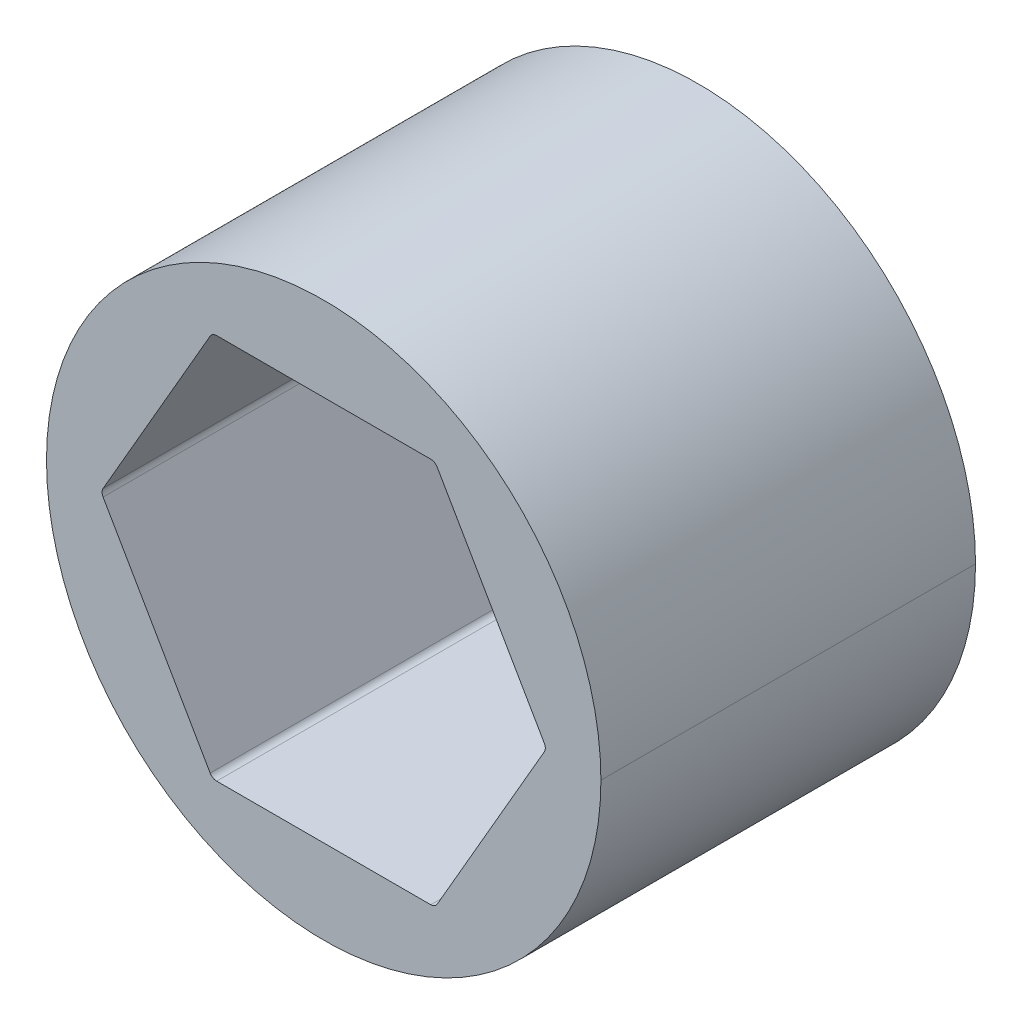
ISO-10303-21;
HEADER;
FILE_DESCRIPTION(('STEP AP214'),'2;1');
FILE_NAME('part.step','',(''),(''),'','','');
FILE_SCHEMA(('AUTOMOTIVE_DESIGN { 1 0 10303 214 1 1 1 1 }'));
ENDSEC;
DATA;
#1=APPLICATION_CONTEXT('core data for automotive mechanical design processes');
#2=APPLICATION_PROTOCOL_DEFINITION('international standard','automotive_design',2000,#1);
#3=PRODUCT_CONTEXT('',#1,'mechanical');
#4=PRODUCT('Part','Part','',(#3));
#5=PRODUCT_RELATED_PRODUCT_CATEGORY('part','',(#4));
#6=PRODUCT_DEFINITION_FORMATION('','',#4);
#7=PRODUCT_DEFINITION_CONTEXT('part definition',#1,'design');
#8=PRODUCT_DEFINITION('design','',#6,#7);
#9=PRODUCT_DEFINITION_SHAPE('','',#8);
#10=(LENGTH_UNIT() NAMED_UNIT(*) SI_UNIT(.MILLI.,.METRE.));
#11=(NAMED_UNIT(*) PLANE_ANGLE_UNIT() SI_UNIT($,.RADIAN.));
#12=(NAMED_UNIT(*) SI_UNIT($,.STERADIAN.) SOLID_ANGLE_UNIT());
#13=UNCERTAINTY_MEASURE_WITH_UNIT(LENGTH_MEASURE(1.E-05),#10,'distance_accuracy_value','');
#14=(GEOMETRIC_REPRESENTATION_CONTEXT(3) GLOBAL_UNCERTAINTY_ASSIGNED_CONTEXT((#13)) GLOBAL_UNIT_ASSIGNED_CONTEXT((#10,
#11,#12)) REPRESENTATION_CONTEXT('',''));
#15=CARTESIAN_POINT('',(0.,0.,0.));
#16=DIRECTION('',(0.,0.,1.));
#17=DIRECTION('',(1.,0.,0.));
#18=AXIS2_PLACEMENT_3D('',#15,#16,#17);
#19=CARTESIAN_POINT('',(7.25902493452117,0.,30.48));
#20=DIRECTION('',(0.,0.,1.));
#21=DIRECTION('',(1.,0.,0.));
#22=AXIS2_PLACEMENT_3D('',#19,#20,#21);
#23=CYLINDRICAL_SURFACE('',#22,0.254);
#24=CARTESIAN_POINT('',(7.25902493452117,0.,12.7));
#25=DIRECTION('',(0.,0.,1.));
#26=DIRECTION('',(1.,0.,0.));
#27=AXIS2_PLACEMENT_3D('',#24,#25,#26);
#28=CIRCLE('',#27,0.254);
#29=CARTESIAN_POINT('',(7.47899538708242,0.127,12.7));
#30=VERTEX_POINT('',#29);
#31=CARTESIAN_POINT('',(7.51302493452117,0.,12.7));
#32=VERTEX_POINT('',#31);
#33=EDGE_CURVE('E303',#30,#32,#28,.F.);
#34=ORIENTED_EDGE('',*,*,#33,.F.);
#35=DIRECTION('',(0.,0.,1.));
#36=VECTOR('',#35,1.);
#37=CARTESIAN_POINT('',(7.47899538708242,0.127,30.48));
#38=LINE('',#37,#36);
#39=CARTESIAN_POINT('',(7.47899538708242,0.127,0.));
#40=VERTEX_POINT('',#39);
#41=EDGE_CURVE('E269',#40,#30,#38,.T.);
#42=ORIENTED_EDGE('',*,*,#41,.F.);
#43=CARTESIAN_POINT('',(7.25902493452117,0.,0.));
#44=DIRECTION('',(0.,0.,1.));
#45=DIRECTION('',(1.,0.,0.));
#46=AXIS2_PLACEMENT_3D('',#43,#44,#45);
#47=CIRCLE('',#46,0.254);
#48=CARTESIAN_POINT('',(7.51302493452117,0.,0.));
#49=VERTEX_POINT('',#48);
#50=EDGE_CURVE('E201',#49,#40,#47,.T.);
#51=ORIENTED_EDGE('',*,*,#50,.F.);
#52=DIRECTION('',(0.,0.,1.));
#53=VECTOR('',#52,1.);
#54=CARTESIAN_POINT('',(7.51302493452117,0.,30.48));
#55=LINE('',#54,#53);
#56=EDGE_CURVE('E54',#49,#32,#55,.T.);
#57=ORIENTED_EDGE('',*,*,#56,.T.);
#58=EDGE_LOOP('',(#34,#42,#51,#57));
#59=FACE_BOUND('',#58,.T.);
#60=ADVANCED_FACE('F45',(#59),#23,.F.);
#61=CARTESIAN_POINT('',(0.,0.,30.48));
#62=DIRECTION('',(0.,0.,-1.));
#63=DIRECTION('',(-1.,0.,0.));
#64=AXIS2_PLACEMENT_3D('',#61,#62,#63);
#65=CYLINDRICAL_SURFACE('',#64,9.398);
#66=DIRECTION('',(0.,0.,-1.));
#67=VECTOR('',#66,1.);
#68=CARTESIAN_POINT('',(-9.398,0.,30.48));
#69=LINE('',#68,#67);
#70=CARTESIAN_POINT('',(-9.398,0.,12.7));
#71=VERTEX_POINT('',#70);
#72=CARTESIAN_POINT('',(-9.398,0.,0.));
#73=VERTEX_POINT('',#72);
#74=EDGE_CURVE('E176',#71,#73,#69,.T.);
#75=ORIENTED_EDGE('',*,*,#74,.F.);
#76=CARTESIAN_POINT('',(0.,0.,12.7));
#77=DIRECTION('',(0.,0.,1.));
#78=DIRECTION('',(1.,0.,0.));
#79=AXIS2_PLACEMENT_3D('',#76,#77,#78);
#80=CIRCLE('',#79,9.398);
#81=CARTESIAN_POINT('',(9.398,0.,12.7));
#82=VERTEX_POINT('',#81);
#83=EDGE_CURVE('E60',#82,#71,#80,.T.);
#84=ORIENTED_EDGE('',*,*,#83,.F.);
#85=DIRECTION('',(0.,0.,-1.));
#86=VECTOR('',#85,1.);
#87=CARTESIAN_POINT('',(9.398,0.,30.48));
#88=LINE('',#87,#86);
#89=CARTESIAN_POINT('',(9.398,0.,0.));
#90=VERTEX_POINT('',#89);
#91=EDGE_CURVE('E174',#82,#90,#88,.T.);
#92=ORIENTED_EDGE('',*,*,#91,.T.);
#93=CARTESIAN_POINT('',(0.,0.,0.));
#94=DIRECTION('',(0.,0.,1.));
#95=DIRECTION('',(1.,0.,0.));
#96=AXIS2_PLACEMENT_3D('',#93,#94,#95);
#97=CIRCLE('',#96,9.398);
#98=EDGE_CURVE('E183',#90,#73,#97,.T.);
#99=ORIENTED_EDGE('',*,*,#98,.T.);
#100=EDGE_LOOP('',(#75,#84,#92,#99));
#101=FACE_BOUND('',#100,.T.);
#102=ADVANCED_FACE('F172',(#101),#65,.T.);
#103=CARTESIAN_POINT('',(0.,0.,30.48));
#104=DIRECTION('',(0.,0.,-1.));
#105=DIRECTION('',(-1.,0.,0.));
#106=AXIS2_PLACEMENT_3D('',#103,#104,#105);
#107=CYLINDRICAL_SURFACE('',#106,9.398);
#108=ORIENTED_EDGE('',*,*,#91,.F.);
#109=EDGE_CURVE('E164',#71,#82,#80,.T.);
#110=ORIENTED_EDGE('',*,*,#109,.F.);
#111=ORIENTED_EDGE('',*,*,#74,.T.);
#112=CARTESIAN_POINT('',(0.,0.,0.));
#113=DIRECTION('',(0.,0.,1.));
#114=DIRECTION('',(1.,0.,0.));
#115=AXIS2_PLACEMENT_3D('',#112,#113,#114);
#116=CIRCLE('',#115,9.398);
#117=EDGE_CURVE('E181',#73,#90,#116,.T.);
#118=ORIENTED_EDGE('',*,*,#117,.T.);
#119=EDGE_LOOP('',(#108,#110,#111,#118));
#120=FACE_BOUND('',#119,.T.);
#121=ADVANCED_FACE('F179',(#120),#107,.T.);
#122=CARTESIAN_POINT('',(3.77615943563475,-6.5405,30.48));
#123=DIRECTION('',(-0.866025403784439,0.5,0.));
#124=DIRECTION('',(0.,0.,1.));
#125=AXIS2_PLACEMENT_3D('',#122,#123,#124);
#126=PLANE('',#125);
#127=DIRECTION('',(0.,0.,1.));
#128=VECTOR('',#127,1.);
#129=CARTESIAN_POINT('',(3.84948291982184,-6.4135,30.48));
#130=LINE('',#129,#128);
#131=CARTESIAN_POINT('',(3.84948291982184,-6.4135,0.));
#132=VERTEX_POINT('',#131);
#133=CARTESIAN_POINT('',(3.84948291982184,-6.4135,12.7));
#134=VERTEX_POINT('',#133);
#135=EDGE_CURVE('E220',#132,#134,#130,.T.);
#136=ORIENTED_EDGE('',*,*,#135,.T.);
#137=DIRECTION('',(0.5,0.866025403784439,0.));
#138=VECTOR('',#137,1.);
#139=CARTESIAN_POINT('',(3.77615943563475,-6.5405,12.7));
#140=LINE('',#139,#138);
#141=CARTESIAN_POINT('',(7.47899538708242,-0.127000000000001,12.7));
#142=VERTEX_POINT('',#141);
#143=EDGE_CURVE('E313',#134,#142,#140,.T.);
#144=ORIENTED_EDGE('',*,*,#143,.T.);
#145=DIRECTION('',(0.,0.,-1.));
#146=VECTOR('',#145,1.);
#147=CARTESIAN_POINT('',(7.47899538708242,-0.127,0.));
#148=LINE('',#147,#146);
#149=CARTESIAN_POINT('',(7.47899538708242,-0.127000000000001,0.));
#150=VERTEX_POINT('',#149);
#151=EDGE_CURVE('E224',#142,#150,#148,.T.);
#152=ORIENTED_EDGE('',*,*,#151,.T.);
#153=DIRECTION('',(0.5,0.866025403784439,0.));
#154=VECTOR('',#153,1.);
#155=CARTESIAN_POINT('',(3.77615943563475,-6.5405,0.));
#156=LINE('',#155,#154);
#157=EDGE_CURVE('E200',#132,#150,#156,.T.);
#158=ORIENTED_EDGE('',*,*,#157,.F.);
#159=EDGE_LOOP('',(#136,#144,#152,#158));
#160=FACE_BOUND('',#159,.T.);
#161=ADVANCED_FACE('F465',(#160),#126,.T.);
#162=CARTESIAN_POINT('',(7.5523188712695,0.,30.48));
#163=DIRECTION('',(-0.866025403784438,-0.5,0.));
#164=DIRECTION('',(-0.5,0.866025403784438,0.));
#165=AXIS2_PLACEMENT_3D('',#162,#163,#164);
#166=PLANE('',#165);
#167=ORIENTED_EDGE('',*,*,#41,.T.);
#168=DIRECTION('',(-0.5,0.866025403784438,0.));
#169=VECTOR('',#168,1.);
#170=CARTESIAN_POINT('',(7.5523188712695,0.,12.7));
#171=LINE('',#170,#169);
#172=CARTESIAN_POINT('',(3.84948291982183,6.4135,12.7));
#173=VERTEX_POINT('',#172);
#174=EDGE_CURVE('E298',#30,#173,#171,.T.);
#175=ORIENTED_EDGE('',*,*,#174,.T.);
#176=DIRECTION('',(0.,0.,-1.));
#177=VECTOR('',#176,1.);
#178=CARTESIAN_POINT('',(3.84948291982183,6.4135,0.));
#179=LINE('',#178,#177);
#180=CARTESIAN_POINT('',(3.84948291982183,6.4135,0.));
#181=VERTEX_POINT('',#180);
#182=EDGE_CURVE('E230',#173,#181,#179,.T.);
#183=ORIENTED_EDGE('',*,*,#182,.T.);
#184=DIRECTION('',(-0.5,0.866025403784438,0.));
#185=VECTOR('',#184,1.);
#186=CARTESIAN_POINT('',(7.5523188712695,0.,0.));
#187=LINE('',#186,#185);
#188=EDGE_CURVE('E228',#40,#181,#187,.T.);
#189=ORIENTED_EDGE('',*,*,#188,.F.);
#190=EDGE_LOOP('',(#167,#175,#183,#189));
#191=FACE_BOUND('',#190,.T.);
#192=ADVANCED_FACE('F297',(#191),#166,.T.);
#193=CARTESIAN_POINT('',(3.77615943563475,6.5405,30.48));
#194=DIRECTION('',(0.,-1.,0.));
#195=DIRECTION('',(0.,0.,-1.));
#196=AXIS2_PLACEMENT_3D('',#193,#194,#195);
#197=PLANE('',#196);
#198=DIRECTION('',(0.,0.,1.));
#199=VECTOR('',#198,1.);
#200=CARTESIAN_POINT('',(3.62951246726058,6.5405,30.48));
#201=LINE('',#200,#199);
#202=CARTESIAN_POINT('',(3.62951246726058,6.5405,0.));
#203=VERTEX_POINT('',#202);
#204=CARTESIAN_POINT('',(3.62951246726058,6.5405,12.7));
#205=VERTEX_POINT('',#204);
#206=EDGE_CURVE('E265',#203,#205,#201,.T.);
#207=ORIENTED_EDGE('',*,*,#206,.T.);
#208=DIRECTION('',(-1.,0.,0.));
#209=VECTOR('',#208,1.);
#210=CARTESIAN_POINT('',(3.77615943563475,6.5405,12.7));
#211=LINE('',#210,#209);
#212=CARTESIAN_POINT('',(-3.62951246726058,6.5405,12.7));
#213=VERTEX_POINT('',#212);
#214=EDGE_CURVE('E325',#205,#213,#211,.T.);
#215=ORIENTED_EDGE('',*,*,#214,.T.);
#216=DIRECTION('',(0.,0.,-1.));
#217=VECTOR('',#216,1.);
#218=CARTESIAN_POINT('',(-3.62951246726058,6.5405,0.));
#219=LINE('',#218,#217);
#220=CARTESIAN_POINT('',(-3.62951246726058,6.5405,0.));
#221=VERTEX_POINT('',#220);
#222=EDGE_CURVE('E270',#213,#221,#219,.T.);
#223=ORIENTED_EDGE('',*,*,#222,.T.);
#224=DIRECTION('',(-1.,0.,0.));
#225=VECTOR('',#224,1.);
#226=CARTESIAN_POINT('',(3.77615943563475,6.5405,0.));
#227=LINE('',#226,#225);
#228=EDGE_CURVE('E253',#203,#221,#227,.T.);
#229=ORIENTED_EDGE('',*,*,#228,.F.);
#230=EDGE_LOOP('',(#207,#215,#223,#229));
#231=FACE_BOUND('',#230,.T.);
#232=ADVANCED_FACE('F484',(#231),#197,.T.);
#233=CARTESIAN_POINT('',(-3.77615943563474,6.5405,30.48));
#234=DIRECTION('',(0.866025403784439,-0.5,0.));
#235=DIRECTION('',(0.,0.,-1.));
#236=AXIS2_PLACEMENT_3D('',#233,#234,#235);
#237=PLANE('',#236);
#238=DIRECTION('',(0.,0.,1.));
#239=VECTOR('',#238,1.);
#240=CARTESIAN_POINT('',(-3.84948291982183,6.4135,30.48));
#241=LINE('',#240,#239);
#242=CARTESIAN_POINT('',(-3.84948291982183,6.4135,0.));
#243=VERTEX_POINT('',#242);
#244=CARTESIAN_POINT('',(-3.84948291982183,6.4135,12.7));
#245=VERTEX_POINT('',#244);
#246=EDGE_CURVE('E194',#243,#245,#241,.T.);
#247=ORIENTED_EDGE('',*,*,#246,.T.);
#248=DIRECTION('',(-0.5,-0.866025403784439,0.));
#249=VECTOR('',#248,1.);
#250=CARTESIAN_POINT('',(-3.77615943563474,6.5405,12.7));
#251=LINE('',#250,#249);
#252=CARTESIAN_POINT('',(-7.47899538708242,0.127000000000006,12.7));
#253=VERTEX_POINT('',#252);
#254=EDGE_CURVE('E339',#245,#253,#251,.T.);
#255=ORIENTED_EDGE('',*,*,#254,.T.);
#256=DIRECTION('',(0.,0.,-1.));
#257=VECTOR('',#256,1.);
#258=CARTESIAN_POINT('',(-7.47899538708241,0.127000000000002,0.));
#259=LINE('',#258,#257);
#260=CARTESIAN_POINT('',(-7.47899538708241,0.127000000000003,0.));
#261=VERTEX_POINT('',#260);
#262=EDGE_CURVE('E243',#253,#261,#259,.T.);
#263=ORIENTED_EDGE('',*,*,#262,.T.);
#264=DIRECTION('',(-0.5,-0.866025403784439,0.));
#265=VECTOR('',#264,1.);
#266=CARTESIAN_POINT('',(-3.77615943563474,6.5405,0.));
#267=LINE('',#266,#265);
#268=EDGE_CURVE('E254',#243,#261,#267,.T.);
#269=ORIENTED_EDGE('',*,*,#268,.F.);
#270=EDGE_LOOP('',(#247,#255,#263,#269));
#271=FACE_BOUND('',#270,.T.);
#272=ADVANCED_FACE('F360',(#271),#237,.T.);
#273=CARTESIAN_POINT('',(-7.5523188712695,0.,30.48));
#274=DIRECTION('',(0.866025403784439,0.5,0.));
#275=DIRECTION('',(0.,0.,-1.));
#276=AXIS2_PLACEMENT_3D('',#273,#274,#275);
#277=PLANE('',#276);
#278=DIRECTION('',(0.,0.,1.));
#279=VECTOR('',#278,1.);
#280=CARTESIAN_POINT('',(-7.47899538708241,-0.126999999999998,30.48));
#281=LINE('',#280,#279);
#282=CARTESIAN_POINT('',(-7.47899538708241,-0.126999999999999,0.));
#283=VERTEX_POINT('',#282);
#284=CARTESIAN_POINT('',(-7.47899538708241,-0.126999999999998,12.7));
#285=VERTEX_POINT('',#284);
#286=EDGE_CURVE('E207',#283,#285,#281,.T.);
#287=ORIENTED_EDGE('',*,*,#286,.T.);
#288=DIRECTION('',(0.5,-0.866025403784439,0.));
#289=VECTOR('',#288,1.);
#290=CARTESIAN_POINT('',(-7.5523188712695,0.,12.7));
#291=LINE('',#290,#289);
#292=CARTESIAN_POINT('',(-3.84948291982184,-6.4135,12.7));
#293=VERTEX_POINT('',#292);
#294=EDGE_CURVE('E67',#285,#293,#291,.T.);
#295=ORIENTED_EDGE('',*,*,#294,.T.);
#296=DIRECTION('',(0.,0.,-1.));
#297=VECTOR('',#296,1.);
#298=CARTESIAN_POINT('',(-3.84948291982183,-6.4135,0.));
#299=LINE('',#298,#297);
#300=CARTESIAN_POINT('',(-3.84948291982183,-6.4135,0.));
#301=VERTEX_POINT('',#300);
#302=EDGE_CURVE('E211',#293,#301,#299,.T.);
#303=ORIENTED_EDGE('',*,*,#302,.T.);
#304=DIRECTION('',(0.5,-0.866025403784439,0.));
#305=VECTOR('',#304,1.);
#306=CARTESIAN_POINT('',(-7.5523188712695,0.,0.));
#307=LINE('',#306,#305);
#308=EDGE_CURVE('E219',#283,#301,#307,.T.);
#309=ORIENTED_EDGE('',*,*,#308,.F.);
#310=EDGE_LOOP('',(#287,#295,#303,#309));
#311=FACE_BOUND('',#310,.T.);
#312=ADVANCED_FACE('F346',(#311),#277,.T.);
#313=CARTESIAN_POINT('',(-3.77615943563474,-6.5405,30.48));
#314=DIRECTION('',(0.,1.,0.));
#315=DIRECTION('',(1.,0.,0.));
#316=AXIS2_PLACEMENT_3D('',#313,#314,#315);
#317=PLANE('',#316);
#318=DIRECTION('',(0.,0.,1.));
#319=VECTOR('',#318,1.);
#320=CARTESIAN_POINT('',(-3.62951246726058,-6.5405,30.48));
#321=LINE('',#320,#319);
#322=CARTESIAN_POINT('',(-3.62951246726058,-6.5405,0.));
#323=VERTEX_POINT('',#322);
#324=CARTESIAN_POINT('',(-3.62951246726058,-6.5405,12.7));
#325=VERTEX_POINT('',#324);
#326=EDGE_CURVE('E205',#323,#325,#321,.T.);
#327=ORIENTED_EDGE('',*,*,#326,.T.);
#328=DIRECTION('',(1.,0.,0.));
#329=VECTOR('',#328,1.);
#330=CARTESIAN_POINT('',(-3.77615943563474,-6.5405,12.7));
#331=LINE('',#330,#329);
#332=CARTESIAN_POINT('',(3.62951246726059,-6.5405,12.7));
#333=VERTEX_POINT('',#332);
#334=EDGE_CURVE('E329',#325,#333,#331,.T.);
#335=ORIENTED_EDGE('',*,*,#334,.T.);
#336=DIRECTION('',(0.,0.,-1.));
#337=VECTOR('',#336,1.);
#338=CARTESIAN_POINT('',(3.62951246726059,-6.5405,0.));
#339=LINE('',#338,#337);
#340=CARTESIAN_POINT('',(3.62951246726058,-6.5405,0.));
#341=VERTEX_POINT('',#340);
#342=EDGE_CURVE('E202',#333,#341,#339,.T.);
#343=ORIENTED_EDGE('',*,*,#342,.T.);
#344=DIRECTION('',(1.,0.,0.));
#345=VECTOR('',#344,1.);
#346=CARTESIAN_POINT('',(-3.77615943563474,-6.5405,0.));
#347=LINE('',#346,#345);
#348=EDGE_CURVE('E190',#323,#341,#347,.T.);
#349=ORIENTED_EDGE('',*,*,#348,.F.);
#350=EDGE_LOOP('',(#327,#335,#343,#349));
#351=FACE_BOUND('',#350,.T.);
#352=ADVANCED_FACE('F510',(#351),#317,.T.);
#353=CARTESIAN_POINT('',(3.62951246726058,6.2865,30.48));
#354=DIRECTION('',(0.,0.,1.));
#355=DIRECTION('',(1.,0.,0.));
#356=AXIS2_PLACEMENT_3D('',#353,#354,#355);
#357=CYLINDRICAL_SURFACE('',#356,0.254);
#358=CARTESIAN_POINT('',(3.62951246726058,6.2865,12.7));
#359=DIRECTION('',(0.,0.,1.));
#360=DIRECTION('',(1.,0.,0.));
#361=AXIS2_PLACEMENT_3D('',#358,#359,#360);
#362=CIRCLE('',#361,0.254);
#363=EDGE_CURVE('E319',#205,#173,#362,.F.);
#364=ORIENTED_EDGE('',*,*,#363,.F.);
#365=ORIENTED_EDGE('',*,*,#206,.F.);
#366=CARTESIAN_POINT('',(3.62951246726058,6.2865,0.));
#367=DIRECTION('',(0.,0.,1.));
#368=DIRECTION('',(1.,0.,0.));
#369=AXIS2_PLACEMENT_3D('',#366,#367,#368);
#370=CIRCLE('',#369,0.254);
#371=EDGE_CURVE('E258',#181,#203,#370,.T.);
#372=ORIENTED_EDGE('',*,*,#371,.F.);
#373=ORIENTED_EDGE('',*,*,#182,.F.);
#374=EDGE_LOOP('',(#364,#365,#372,#373));
#375=FACE_BOUND('',#374,.T.);
#376=ADVANCED_FACE('F519',(#375),#357,.F.);
#377=CARTESIAN_POINT('',(-3.62951246726058,6.2865,30.48));
#378=DIRECTION('',(0.,0.,1.));
#379=DIRECTION('',(1.,0.,0.));
#380=AXIS2_PLACEMENT_3D('',#377,#378,#379);
#381=CYLINDRICAL_SURFACE('',#380,0.254);
#382=CARTESIAN_POINT('',(-3.62951246726058,6.2865,12.7));
#383=DIRECTION('',(0.,0.,1.));
#384=DIRECTION('',(1.,0.,0.));
#385=AXIS2_PLACEMENT_3D('',#382,#383,#384);
#386=CIRCLE('',#385,0.254);
#387=EDGE_CURVE('E333',#245,#213,#386,.F.);
#388=ORIENTED_EDGE('',*,*,#387,.F.);
#389=ORIENTED_EDGE('',*,*,#246,.F.);
#390=CARTESIAN_POINT('',(-3.62951246726058,6.2865,0.));
#391=DIRECTION('',(0.,0.,1.));
#392=DIRECTION('',(1.,0.,0.));
#393=AXIS2_PLACEMENT_3D('',#390,#391,#392);
#394=CIRCLE('',#393,0.254);
#395=EDGE_CURVE('E249',#221,#243,#394,.T.);
#396=ORIENTED_EDGE('',*,*,#395,.F.);
#397=ORIENTED_EDGE('',*,*,#222,.F.);
#398=EDGE_LOOP('',(#388,#389,#396,#397));
#399=FACE_BOUND('',#398,.T.);
#400=ADVANCED_FACE('F528',(#399),#381,.F.);
#401=CARTESIAN_POINT('',(-3.62951246726058,-6.2865,30.48));
#402=DIRECTION('',(0.,0.,1.));
#403=DIRECTION('',(1.,0.,0.));
#404=AXIS2_PLACEMENT_3D('',#401,#402,#403);
#405=CYLINDRICAL_SURFACE('',#404,0.254);
#406=CARTESIAN_POINT('',(-3.62951246726058,-6.2865,12.7));
#407=DIRECTION('',(0.,0.,1.));
#408=DIRECTION('',(1.,0.,0.));
#409=AXIS2_PLACEMENT_3D('',#406,#407,#408);
#410=CIRCLE('',#409,0.254);
#411=EDGE_CURVE('E336',#325,#293,#410,.F.);
#412=ORIENTED_EDGE('',*,*,#411,.F.);
#413=ORIENTED_EDGE('',*,*,#326,.F.);
#414=CARTESIAN_POINT('',(-3.62951246726058,-6.2865,0.));
#415=DIRECTION('',(0.,0.,1.));
#416=DIRECTION('',(1.,0.,0.));
#417=AXIS2_PLACEMENT_3D('',#414,#415,#416);
#418=CIRCLE('',#417,0.254);
#419=EDGE_CURVE('E216',#301,#323,#418,.T.);
#420=ORIENTED_EDGE('',*,*,#419,.F.);
#421=ORIENTED_EDGE('',*,*,#302,.F.);
#422=EDGE_LOOP('',(#412,#413,#420,#421));
#423=FACE_BOUND('',#422,.T.);
#424=ADVANCED_FACE('F351',(#423),#405,.F.);
#425=CARTESIAN_POINT('',(3.62951246726059,-6.2865,30.48));
#426=DIRECTION('',(0.,0.,1.));
#427=DIRECTION('',(1.,0.,0.));
#428=AXIS2_PLACEMENT_3D('',#425,#426,#427);
#429=CYLINDRICAL_SURFACE('',#428,0.254);
#430=CARTESIAN_POINT('',(3.62951246726059,-6.2865,12.7));
#431=DIRECTION('',(0.,0.,1.));
#432=DIRECTION('',(1.,0.,0.));
#433=AXIS2_PLACEMENT_3D('',#430,#431,#432);
#434=CIRCLE('',#433,0.254);
#435=EDGE_CURVE('E322',#134,#333,#434,.F.);
#436=ORIENTED_EDGE('',*,*,#435,.F.);
#437=ORIENTED_EDGE('',*,*,#135,.F.);
#438=CARTESIAN_POINT('',(3.62951246726059,-6.2865,0.));
#439=DIRECTION('',(0.,0.,1.));
#440=DIRECTION('',(1.,0.,0.));
#441=AXIS2_PLACEMENT_3D('',#438,#439,#440);
#442=CIRCLE('',#441,0.254);
#443=EDGE_CURVE('E212',#341,#132,#442,.T.);
#444=ORIENTED_EDGE('',*,*,#443,.F.);
#445=ORIENTED_EDGE('',*,*,#342,.F.);
#446=EDGE_LOOP('',(#436,#437,#444,#445));
#447=FACE_BOUND('',#446,.T.);
#448=ADVANCED_FACE('F394',(#447),#429,.F.);
#449=CARTESIAN_POINT('',(7.25902493452117,0.,30.48));
#450=DIRECTION('',(0.,0.,1.));
#451=DIRECTION('',(1.,0.,0.));
#452=AXIS2_PLACEMENT_3D('',#449,#450,#451);
#453=CYLINDRICAL_SURFACE('',#452,0.254);
#454=CARTESIAN_POINT('',(7.25902493452117,0.,12.7));
#455=DIRECTION('',(0.,0.,1.));
#456=DIRECTION('',(1.,0.,0.));
#457=AXIS2_PLACEMENT_3D('',#454,#455,#456);
#458=CIRCLE('',#457,0.254);
#459=EDGE_CURVE('E206',#32,#142,#458,.F.);
#460=ORIENTED_EDGE('',*,*,#459,.F.);
#461=ORIENTED_EDGE('',*,*,#56,.F.);
#462=CARTESIAN_POINT('',(7.25902493452117,0.,0.));
#463=DIRECTION('',(0.,0.,1.));
#464=DIRECTION('',(1.,0.,0.));
#465=AXIS2_PLACEMENT_3D('',#462,#463,#464);
#466=CIRCLE('',#465,0.254);
#467=EDGE_CURVE('E196',#150,#49,#466,.T.);
#468=ORIENTED_EDGE('',*,*,#467,.F.);
#469=ORIENTED_EDGE('',*,*,#151,.F.);
#470=EDGE_LOOP('',(#460,#461,#468,#469));
#471=FACE_BOUND('',#470,.T.);
#472=ADVANCED_FACE('F309',(#471),#453,.F.);
#473=CARTESIAN_POINT('',(-7.25902493452117,0.,30.48));
#474=DIRECTION('',(0.,0.,1.));
#475=DIRECTION('',(1.,0.,0.));
#476=AXIS2_PLACEMENT_3D('',#473,#474,#475);
#477=CYLINDRICAL_SURFACE('',#476,0.254);
#478=CARTESIAN_POINT('',(-7.25902493452117,0.,12.7));
#479=DIRECTION('',(0.,0.,1.));
#480=DIRECTION('',(1.,0.,0.));
#481=AXIS2_PLACEMENT_3D('',#478,#479,#480);
#482=CIRCLE('',#481,0.254);
#483=EDGE_CURVE('E11',#285,#253,#482,.F.);
#484=ORIENTED_EDGE('',*,*,#483,.F.);
#485=ORIENTED_EDGE('',*,*,#286,.F.);
#486=CARTESIAN_POINT('',(-7.25902493452117,0.,0.));
#487=DIRECTION('',(0.,0.,1.));
#488=DIRECTION('',(1.,0.,0.));
#489=AXIS2_PLACEMENT_3D('',#486,#487,#488);
#490=CIRCLE('',#489,0.254);
#491=EDGE_CURVE('E240',#261,#283,#490,.T.);
#492=ORIENTED_EDGE('',*,*,#491,.F.);
#493=ORIENTED_EDGE('',*,*,#262,.F.);
#494=EDGE_LOOP('',(#484,#485,#492,#493));
#495=FACE_BOUND('',#494,.T.);
#496=ADVANCED_FACE('F47',(#495),#477,.F.);
#497=CARTESIAN_POINT('',(0.,0.,0.));
#498=DIRECTION('',(0.,0.,1.));
#499=DIRECTION('',(1.,0.,0.));
#500=AXIS2_PLACEMENT_3D('',#497,#498,#499);
#501=PLANE('',#500);
#502=ORIENTED_EDGE('',*,*,#117,.F.);
#503=ORIENTED_EDGE('',*,*,#98,.F.);
#504=EDGE_LOOP('',(#502,#503));
#505=FACE_BOUND('',#504,.T.);
#506=ORIENTED_EDGE('',*,*,#348,.T.);
#507=ORIENTED_EDGE('',*,*,#443,.T.);
#508=ORIENTED_EDGE('',*,*,#157,.T.);
#509=ORIENTED_EDGE('',*,*,#467,.T.);
#510=ORIENTED_EDGE('',*,*,#50,.T.);
#511=ORIENTED_EDGE('',*,*,#188,.T.);
#512=ORIENTED_EDGE('',*,*,#371,.T.);
#513=ORIENTED_EDGE('',*,*,#228,.T.);
#514=ORIENTED_EDGE('',*,*,#395,.T.);
#515=ORIENTED_EDGE('',*,*,#268,.T.);
#516=ORIENTED_EDGE('',*,*,#491,.T.);
#517=ORIENTED_EDGE('',*,*,#308,.T.);
#518=ORIENTED_EDGE('',*,*,#419,.T.);
#519=EDGE_LOOP('',(#506,#507,#508,#509,#510,#511,#512,#513,#514,#515,#516,#517,#518));
#520=FACE_BOUND('',#519,.T.);
#521=ADVANCED_FACE('F304',(#505,#520),#501,.F.);
#522=CARTESIAN_POINT('',(0.,0.,12.7));
#523=DIRECTION('',(0.,0.,1.));
#524=DIRECTION('',(1.,0.,0.));
#525=AXIS2_PLACEMENT_3D('',#522,#523,#524);
#526=PLANE('',#525);
#527=ORIENTED_EDGE('',*,*,#83,.T.);
#528=ORIENTED_EDGE('',*,*,#109,.T.);
#529=EDGE_LOOP('',(#527,#528));
#530=FACE_BOUND('',#529,.T.);
#531=ORIENTED_EDGE('',*,*,#459,.T.);
#532=ORIENTED_EDGE('',*,*,#143,.F.);
#533=ORIENTED_EDGE('',*,*,#435,.T.);
#534=ORIENTED_EDGE('',*,*,#334,.F.);
#535=ORIENTED_EDGE('',*,*,#411,.T.);
#536=ORIENTED_EDGE('',*,*,#294,.F.);
#537=ORIENTED_EDGE('',*,*,#483,.T.);
#538=ORIENTED_EDGE('',*,*,#254,.F.);
#539=ORIENTED_EDGE('',*,*,#387,.T.);
#540=ORIENTED_EDGE('',*,*,#214,.F.);
#541=ORIENTED_EDGE('',*,*,#363,.T.);
#542=ORIENTED_EDGE('',*,*,#174,.F.);
#543=ORIENTED_EDGE('',*,*,#33,.T.);
#544=EDGE_LOOP('',(#531,#532,#533,#534,#535,#536,#537,#538,#539,#540,#541,#542,#543));
#545=FACE_BOUND('',#544,.T.);
#546=ADVANCED_FACE('F165',(#530,#545),#526,.T.);
#547=CLOSED_SHELL('',(#60,#102,#121,#161,#192,#232,#272,#312,#352,#376,#400,#424,#448,#472,#496,
#521,#546));
#548=MANIFOLD_SOLID_BREP('B2',#547);
#549=ADVANCED_BREP_SHAPE_REPRESENTATION('',(#18,#548),#14);
#550=SHAPE_DEFINITION_REPRESENTATION(#9,#549);
ENDSEC;
END-ISO-10303-21;
